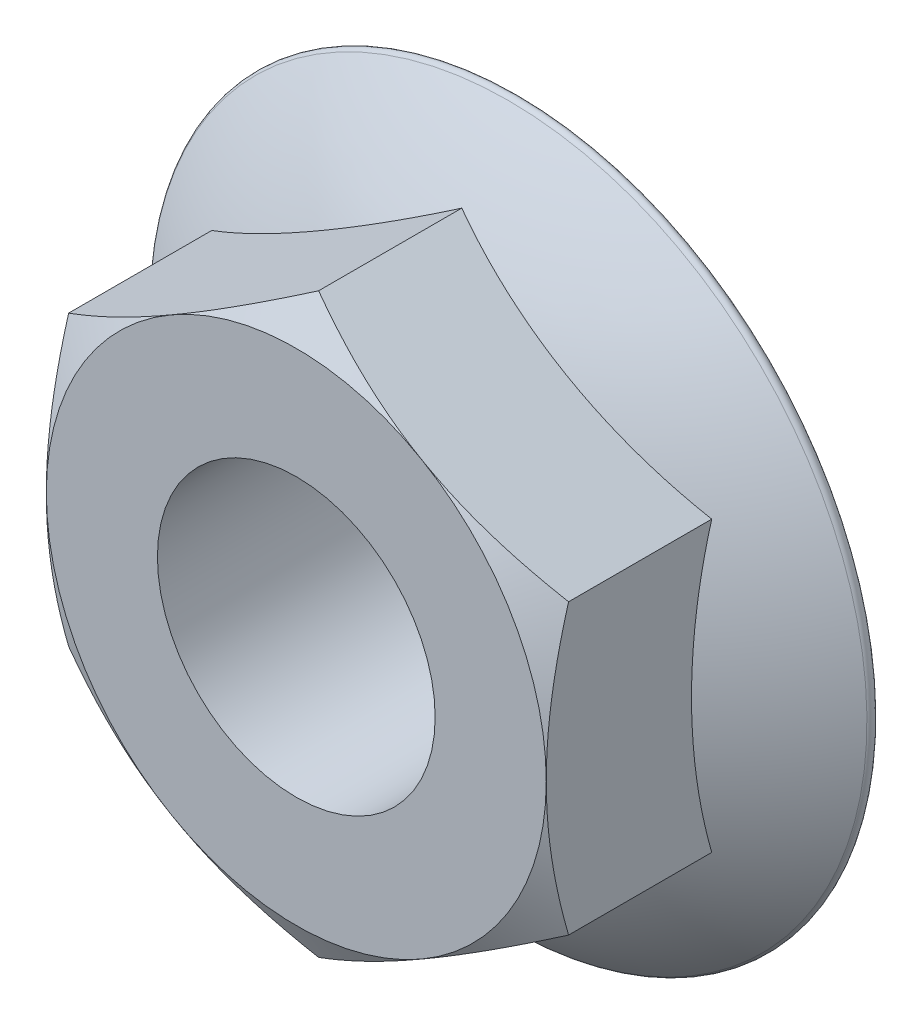
ISO-10303-21;
HEADER;
FILE_DESCRIPTION(('STEP AP214'),'2;1');
FILE_NAME('part.step','',(''),(''),'','','');
FILE_SCHEMA(('AUTOMOTIVE_DESIGN { 1 0 10303 214 1 1 1 1 }'));
ENDSEC;
DATA;
#1=APPLICATION_CONTEXT('core data for automotive mechanical design processes');
#2=APPLICATION_PROTOCOL_DEFINITION('international standard','automotive_design',2000,#1);
#3=PRODUCT_CONTEXT('',#1,'mechanical');
#4=PRODUCT('Part','Part','',(#3));
#5=PRODUCT_RELATED_PRODUCT_CATEGORY('part','',(#4));
#6=PRODUCT_DEFINITION_FORMATION('','',#4);
#7=PRODUCT_DEFINITION_CONTEXT('part definition',#1,'design');
#8=PRODUCT_DEFINITION('design','',#6,#7);
#9=PRODUCT_DEFINITION_SHAPE('','',#8);
#10=(LENGTH_UNIT() NAMED_UNIT(*) SI_UNIT(.MILLI.,.METRE.));
#11=(NAMED_UNIT(*) PLANE_ANGLE_UNIT() SI_UNIT($,.RADIAN.));
#12=(NAMED_UNIT(*) SI_UNIT($,.STERADIAN.) SOLID_ANGLE_UNIT());
#13=UNCERTAINTY_MEASURE_WITH_UNIT(LENGTH_MEASURE(1.E-05),#10,'distance_accuracy_value','');
#14=(GEOMETRIC_REPRESENTATION_CONTEXT(3) GLOBAL_UNCERTAINTY_ASSIGNED_CONTEXT((#13)) GLOBAL_UNIT_ASSIGNED_CONTEXT((#10,
#11,#12)) REPRESENTATION_CONTEXT('',''));
#15=CARTESIAN_POINT('',(0.,0.,0.));
#16=DIRECTION('',(0.,0.,1.));
#17=DIRECTION('',(1.,0.,0.));
#18=AXIS2_PLACEMENT_3D('',#15,#16,#17);
#19=CARTESIAN_POINT('',(0.,-25.9807621135332,20.));
#20=DIRECTION('',(-0.5,0.866025403784439,0.));
#21=DIRECTION('',(-0.866025403784439,-0.5,0.));
#22=AXIS2_PLACEMENT_3D('',#19,#20,#21);
#23=PLANE('',#22);
#24=CARTESIAN_POINT('',(-0.000200000000005805,-25.980877583587,17.9903143896555));
#25=CARTESIAN_POINT('',(0.494340315320349,-25.6953545994117,18.1551492707593));
#26=CARTESIAN_POINT('',(0.990809601239469,-25.4087179235419,18.3125041584607));
#27=CARTESIAN_POINT('',(1.98772926208785,-24.8331460889906,18.6101747825265));
#28=CARTESIAN_POINT('',(2.48818088905228,-24.5442102074463,18.7504849147612));
#29=CARTESIAN_POINT('',(3.49404310444017,-23.9634753866245,19.0121827394148));
#30=CARTESIAN_POINT('',(3.99946257540047,-23.6716713190119,19.1335252438812));
#31=CARTESIAN_POINT('',(5.01379199131473,-23.0860479576868,19.3546738156916));
#32=CARTESIAN_POINT('',(5.52270158333676,-22.7922288677397,19.4544820284597));
#33=CARTESIAN_POINT('',(6.53100308542396,-22.2100857240854,19.6283253044473));
#34=CARTESIAN_POINT('',(7.03032020450329,-21.9218048509739,19.7029352669185));
#35=CARTESIAN_POINT('',(8.03124235456724,-21.3439221781966,19.8280391846674));
#36=CARTESIAN_POINT('',(8.53284742940406,-21.0543203532127,19.8785326757383));
#37=CARTESIAN_POINT('',(9.53690018234172,-20.4746302260236,19.954128715289));
#38=CARTESIAN_POINT('',(10.0393461451645,-20.1845429141346,19.9792614354897));
#39=CARTESIAN_POINT('',(11.0447017408546,-19.6041005903316,20.0035954599864));
#40=CARTESIAN_POINT('',(11.5476113589139,-19.313745586967,20.0027975655861));
#41=CARTESIAN_POINT('',(12.4878094832121,-18.7709219468119,19.9770814657185));
#42=CARTESIAN_POINT('',(12.9251649504396,-18.5184146500766,19.9552991118006));
#43=CARTESIAN_POINT('',(13.7988317564138,-18.0140028844653,19.892536574804));
#44=CARTESIAN_POINT('',(14.2351431100254,-17.7620984070071,19.8515566666916));
#45=CARTESIAN_POINT('',(15.1065604849226,-17.2589853510337,19.7511092481865));
#46=CARTESIAN_POINT('',(15.5416650558498,-17.0077776098833,19.6916250199366));
#47=CARTESIAN_POINT('',(16.4097908378745,-16.5065649559409,19.5552217340813));
#48=CARTESIAN_POINT('',(16.842812057791,-16.2565600380572,19.4783027503465));
#49=CARTESIAN_POINT('',(18.1573722886485,-15.4975983349057,19.2194196562896));
#50=CARTESIAN_POINT('',(19.0351763947766,-14.9907978979369,19.011627893702));
#51=CARTESIAN_POINT('',(20.3421885092524,-14.2361941018102,18.6578721503226));
#52=CARTESIAN_POINT('',(20.7758690162324,-13.985808544363,18.5330695175296));
#53=CARTESIAN_POINT('',(21.6402303188989,-13.4867693135914,18.2708295210671));
#54=CARTESIAN_POINT('',(22.0709119234591,-13.2381151732635,18.1333957185273));
#55=CARTESIAN_POINT('',(22.5002,-12.9902655867127,17.9903143896555));
#56=B_SPLINE_CURVE_WITH_KNOTS('',3,(#24,#25,#26,#27,#28,#29,#30,#31,#32,#33,#34,#35,#36,#37,#38,
#39,#40,#41,#42,#43,#44,#45,#46,#47,#48,#49,#50,#51,#52,#53,#54,#55),.UNSPECIFIED.,.F.,.F.,(4,2,
2,2,2,2,2,2,2,2,2,2,2,2,2,4),(0.,1.78312722203929,3.56683913913433,5.35473780165091,
7.14245825659312,8.88609109738608,10.6297574992032,12.3713470058018,14.1128826941264,
15.6289689473497,17.1450334863602,18.6624717220614,20.1799035285482,23.281607613878,
24.8297579454588,26.3774731352151),.UNSPECIFIED.);
#57=CARTESIAN_POINT('',(0.,-25.9807621135332,17.9903810567666));
#58=VERTEX_POINT('',#57);
#59=CARTESIAN_POINT('',(11.25,-19.4855715851499,20.));
#60=VERTEX_POINT('',#59);
#61=EDGE_CURVE('E224',#58,#60,#56,.T.);
#62=ORIENTED_EDGE('',*,*,#61,.F.);
#63=DIRECTION('',(0.,0.,-1.));
#64=VECTOR('',#63,1.);
#65=CARTESIAN_POINT('',(0.,-25.9807621135332,20.));
#66=LINE('',#65,#64);
#67=CARTESIAN_POINT('',(0.,-25.9807621135332,5.10562126709524));
#68=VERTEX_POINT('',#67);
#69=EDGE_CURVE('E227',#58,#68,#66,.T.);
#70=ORIENTED_EDGE('',*,*,#69,.T.);
#71=CARTESIAN_POINT('',(11.25,-19.4855715851499,-40.4001136363637));
#72=DIRECTION('',(-0.5,0.866025403784439,0.));
#73=DIRECTION('',(-0.866025403784439,-0.5,0.));
#74=AXIS2_PLACEMENT_3D('',#71,#72,#73);
#75=CIRCLE('',#74,47.3235872383305);
#76=CARTESIAN_POINT('',(22.5,-12.9903810567666,5.10562126709525));
#77=VERTEX_POINT('',#76);
#78=EDGE_CURVE('E238',#77,#68,#75,.F.);
#79=ORIENTED_EDGE('',*,*,#78,.F.);
#80=DIRECTION('',(0.,0.,-1.));
#81=VECTOR('',#80,1.);
#82=CARTESIAN_POINT('',(22.5,-12.9903810567666,20.));
#83=LINE('',#82,#81);
#84=CARTESIAN_POINT('',(22.5,-12.9903810567666,17.9903810567666));
#85=VERTEX_POINT('',#84);
#86=EDGE_CURVE('E250',#85,#77,#83,.T.);
#87=ORIENTED_EDGE('',*,*,#86,.F.);
#88=EDGE_CURVE('E177',#60,#85,#56,.T.);
#89=ORIENTED_EDGE('',*,*,#88,.F.);
#90=EDGE_LOOP('',(#62,#70,#79,#87,#89));
#91=FACE_BOUND('',#90,.T.);
#92=ADVANCED_FACE('F45',(#91),#23,.F.);
#93=CARTESIAN_POINT('',(22.5,-12.9903810567666,20.));
#94=DIRECTION('',(-1.,0.,0.));
#95=DIRECTION('',(0.,-1.,0.));
#96=AXIS2_PLACEMENT_3D('',#93,#94,#95);
#97=PLANE('',#96);
#98=CARTESIAN_POINT('',(22.5,-42.937910116955,5.00279973211657));
#99=CARTESIAN_POINT('',(22.5,-42.4349867908762,5.25998830996277));
#100=CARTESIAN_POINT('',(22.5,-41.9316712448641,5.51640961946833));
#101=CARTESIAN_POINT('',(22.5,-40.9241808993457,6.02756274502809));
#102=CARTESIAN_POINT('',(22.5,-40.4200060968718,6.28229455523246));
#103=CARTESIAN_POINT('',(22.5,-38.906067399752,7.04372989587429));
#104=CARTESIAN_POINT('',(22.5,-37.8949075563431,7.54766394292194));
#105=CARTESIAN_POINT('',(22.5,-35.8664336922577,8.54744404798991));
#106=CARTESIAN_POINT('',(22.5,-34.849112085713,9.04327473279685));
#107=CARTESIAN_POINT('',(22.5,-32.8091562949487,10.0239453406089));
#108=CARTESIAN_POINT('',(22.5,-31.7865220333206,10.5087851029147));
#109=CARTESIAN_POINT('',(22.5,-29.6826836887022,11.489168716423));
#110=CARTESIAN_POINT('',(22.5,-28.6011475492797,11.9840015357758));
#111=CARTESIAN_POINT('',(22.5,-26.4295684611349,12.9545883452375));
#112=CARTESIAN_POINT('',(22.5,-25.3395259663007,13.4303433451106));
#113=CARTESIAN_POINT('',(22.5,-23.6970388665296,14.1254074700941));
#114=CARTESIAN_POINT('',(22.5,-23.1484886270678,14.3539282550564));
#115=CARTESIAN_POINT('',(22.5,-22.0485270558716,14.8039685587357));
#116=CARTESIAN_POINT('',(22.5,-21.4971157654287,15.0254881781701));
#117=CARTESIAN_POINT('',(22.5,-20.3909977243873,15.4606074265542));
#118=CARTESIAN_POINT('',(22.5,-19.8362901159973,15.6742048789127));
#119=CARTESIAN_POINT('',(22.5,-18.7234476974617,16.0922649956442));
#120=CARTESIAN_POINT('',(22.5,-18.1653129401696,16.2967278004915));
#121=CARTESIAN_POINT('',(22.5,-16.9449865841485,16.7309016542748));
#122=CARTESIAN_POINT('',(22.5,-16.2820662225517,16.9585738291773));
#123=CARTESIAN_POINT('',(22.5,-14.9505731173334,17.3968937659042));
#124=CARTESIAN_POINT('',(22.5,-14.2820001805723,17.6075409433931));
#125=CARTESIAN_POINT('',(22.5,-12.9391673365046,18.0088123953236));
#126=CARTESIAN_POINT('',(22.5,-12.2649101120209,18.1994456005083));
#127=CARTESIAN_POINT('',(22.5,-10.9102777489049,18.557528643239));
#128=CARTESIAN_POINT('',(22.5,-10.2299030383091,18.7249800895596));
#129=CARTESIAN_POINT('',(22.5,-8.87571641326102,19.0303528579027));
#130=CARTESIAN_POINT('',(22.5,-8.20201537871786,19.1687624656118));
#131=CARTESIAN_POINT('',(22.5,-6.84925952001051,19.4164959045111));
#132=CARTESIAN_POINT('',(22.5,-6.17020484117955,19.5258205224797));
#133=CARTESIAN_POINT('',(22.5,-4.8079571222068,19.7122164762278));
#134=CARTESIAN_POINT('',(22.5,-4.12476611922572,19.7893025566878));
#135=CARTESIAN_POINT('',(22.5,-2.75533096919535,19.9087926707029));
#136=CARTESIAN_POINT('',(22.5,-2.06908684258475,19.9511969360801));
#137=CARTESIAN_POINT('',(22.5,-0.687324246377995,20.0001091636126));
#138=CARTESIAN_POINT('',(22.5,0.00820938704600616,20.0061945929854));
#139=CARTESIAN_POINT('',(22.5,1.39859832033208,19.9811125243047));
#140=CARTESIAN_POINT('',(22.5,2.09345361787948,19.9499448995746));
#141=CARTESIAN_POINT('',(22.5,3.48080015469796,19.8514850050863));
#142=CARTESIAN_POINT('',(22.5,4.1732905467787,19.7841809279115));
#143=CARTESIAN_POINT('',(22.5,5.55411755952299,19.6157455550603));
#144=CARTESIAN_POINT('',(22.5,6.24245408545504,19.5146134908613));
#145=CARTESIAN_POINT('',(22.5,7.62722706977454,19.2793387973371));
#146=CARTESIAN_POINT('',(22.5,8.32355984305465,19.1445910821305));
#147=CARTESIAN_POINT('',(22.5,9.71010675509671,18.846809177478));
#148=CARTESIAN_POINT('',(22.5,10.4003208338406,18.6837747108902));
#149=CARTESIAN_POINT('',(22.5,11.7745189775227,18.3330815856482));
#150=CARTESIAN_POINT('',(22.5,12.4585022055107,18.1454196696198));
#151=CARTESIAN_POINT('',(22.5,13.8202809477323,17.7489421717333));
#152=CARTESIAN_POINT('',(22.5,14.4980764221406,17.5401264538304));
#153=CARTESIAN_POINT('',(22.5,15.7921426442065,17.122402240074));
#154=CARTESIAN_POINT('',(22.5,16.408876911634,16.9149219806037));
#155=CARTESIAN_POINT('',(22.5,17.6377869149723,16.4868319747096));
#156=CARTESIAN_POINT('',(22.5,18.2499624656504,16.2662216980187));
#157=CARTESIAN_POINT('',(22.5,19.4702017344588,15.8136516015775));
#158=CARTESIAN_POINT('',(22.5,20.0782647898368,15.5816899998701));
#159=CARTESIAN_POINT('',(22.5,21.2905575041822,15.1079993142826));
#160=CARTESIAN_POINT('',(22.5,21.8947872099299,14.8662703498649));
#161=CARTESIAN_POINT('',(22.5,23.1003484017779,14.3741314470397));
#162=CARTESIAN_POINT('',(22.5,23.7016766801851,14.1237136653835));
#163=CARTESIAN_POINT('',(22.5,24.9012239962781,13.6155267116629));
#164=CARTESIAN_POINT('',(22.5,25.4994429898334,13.3577574355927));
#165=CARTESIAN_POINT('',(22.5,26.6930217519426,12.8358485601786));
#166=CARTESIAN_POINT('',(22.5,27.2883817976791,12.5717095939821));
#167=CARTESIAN_POINT('',(22.5,28.4765906338492,12.0378380893407));
#168=CARTESIAN_POINT('',(22.5,29.0694394044817,11.7681055068895));
#169=CARTESIAN_POINT('',(22.5,30.7817709336552,10.9804762057214));
#170=CARTESIAN_POINT('',(22.5,31.8983456673484,10.4562536555283));
#171=CARTESIAN_POINT('',(22.5,34.124920581488,9.39399908091057));
#172=CARTESIAN_POINT('',(22.5,35.2349205776655,8.8559666716726));
#173=CARTESIAN_POINT('',(22.5,37.4463300983147,7.77041638266379));
#174=CARTESIAN_POINT('',(22.5,38.5477551094307,7.22293001683052));
#175=CARTESIAN_POINT('',(22.5,40.1964930693805,6.39505102381712));
#176=CARTESIAN_POINT('',(22.5,40.745485226106,6.117993657155));
#177=CARTESIAN_POINT('',(22.5,41.8424430578517,5.56186024348552));
#178=CARTESIAN_POINT('',(22.5,42.3904087376387,5.28278420588177));
#179=CARTESIAN_POINT('',(22.5,42.937910116955,5.00279973211658));
#180=B_SPLINE_CURVE_WITH_KNOTS('',3,(#98,#99,#100,#101,#102,#103,#104,#105,#106,#107,#108,#109,
#110,#111,#112,#113,#114,#115,#116,#117,#118,#119,#120,#121,#122,#123,#124,#125,#126,#127,#128,
#129,#130,#131,#132,#133,#134,#135,#136,#137,#138,#139,#140,#141,#142,#143,#144,#145,#146,#147,
#148,#149,#150,#151,#152,#153,#154,#155,#156,#157,#158,#159,#160,#161,#162,#163,#164,#165,#166,
#167,#168,#169,#170,#171,#172,#173,#174,#175,#176,#177,#178,#179),.UNSPECIFIED.,.F.,.F.,(4,2,2,
2,2,2,2,2,2,2,2,2,2,2,2,2,2,2,2,2,2,2,2,2,2,2,2,2,2,2,2,2,2,2,2,2,2,2,2,2,4),(0.,
1.69460800721614,3.38922187888549,6.77851144025748,10.1736205822667,13.5687793325238,
17.1367290228506,20.7044896163155,22.4871908668035,24.2698664600163,26.0530282634379,
27.83616263562,29.9387425585486,32.0413946160485,34.1431043928186,36.2446682413239,
38.307417211311,40.3701103761814,42.431859109237,44.4935940609253,46.579269162215,
48.6649513557284,50.7513154512245,52.8377269490868,54.9648116511539,57.0919171946992,
59.2193043660852,61.3467052200283,63.2986367527605,65.250647169518,67.2029650065895,
69.1552589725683,71.1093635950016,73.0634958770022,75.0174347123852,76.9713889257113,
80.6717851506886,84.3722845998144,88.0622051563254,89.9070267613382,91.7518397781164),.UNSPECIFIED.);
#181=CARTESIAN_POINT('',(22.5,0.,20.));
#182=VERTEX_POINT('',#181);
#183=EDGE_CURVE('E278',#85,#182,#180,.T.);
#184=ORIENTED_EDGE('',*,*,#183,.F.);
#185=ORIENTED_EDGE('',*,*,#86,.T.);
#186=CARTESIAN_POINT('',(22.5,0.,-40.4001136363637));
#187=DIRECTION('',(-1.,0.,0.));
#188=DIRECTION('',(0.,-1.,0.));
#189=AXIS2_PLACEMENT_3D('',#186,#187,#188);
#190=CIRCLE('',#189,47.3235872383305);
#191=CARTESIAN_POINT('',(22.5,12.9903810567666,5.10562126709525));
#192=VERTEX_POINT('',#191);
#193=EDGE_CURVE('E242',#192,#77,#190,.F.);
#194=ORIENTED_EDGE('',*,*,#193,.F.);
#195=DIRECTION('',(0.,0.,-1.));
#196=VECTOR('',#195,1.);
#197=CARTESIAN_POINT('',(22.5,12.9903810567666,20.));
#198=LINE('',#197,#196);
#199=CARTESIAN_POINT('',(22.5,12.9903810567666,17.9903810567666));
#200=VERTEX_POINT('',#199);
#201=EDGE_CURVE('E248',#200,#192,#198,.T.);
#202=ORIENTED_EDGE('',*,*,#201,.F.);
#203=EDGE_CURVE('E121',#182,#200,#180,.T.);
#204=ORIENTED_EDGE('',*,*,#203,.F.);
#205=EDGE_LOOP('',(#184,#185,#194,#202,#204));
#206=FACE_BOUND('',#205,.T.);
#207=ADVANCED_FACE('F214',(#206),#97,.F.);
#208=CARTESIAN_POINT('',(22.5,12.9903810567666,20.));
#209=DIRECTION('',(-0.5,-0.866025403784439,0.));
#210=DIRECTION('',(0.866025403784439,-0.5,0.));
#211=AXIS2_PLACEMENT_3D('',#208,#209,#210);
#212=PLANE('',#211);
#213=CARTESIAN_POINT('',(22.5002,12.9902655867127,17.9903143896555));
#214=CARTESIAN_POINT('',(22.0056596846796,13.2757885708881,18.1551492707593));
#215=CARTESIAN_POINT('',(21.5091903987605,13.5624252467579,18.3125041584607));
#216=CARTESIAN_POINT('',(20.5122707379121,14.1379970813091,18.6101747825265));
#217=CARTESIAN_POINT('',(20.0118191109477,14.4269329628534,18.7504849147612));
#218=CARTESIAN_POINT('',(19.0059568955598,15.0076677836753,19.0121827394149));
#219=CARTESIAN_POINT('',(18.5005374245995,15.2994718512879,19.1335252438812));
#220=CARTESIAN_POINT('',(17.4862080086853,15.8850952126129,19.3546738156916));
#221=CARTESIAN_POINT('',(16.9772984166632,16.17891430256,19.4544820284597));
#222=CARTESIAN_POINT('',(15.968996914576,16.7610574462144,19.6283253044473));
#223=CARTESIAN_POINT('',(15.4696797954967,17.0493383193258,19.7029352669185));
#224=CARTESIAN_POINT('',(14.4687576454327,17.6272209921031,19.8280391846674));
#225=CARTESIAN_POINT('',(13.9671525705959,17.916822817087,19.8785326757383));
#226=CARTESIAN_POINT('',(12.9630998176583,18.4965129442762,19.954128715289));
#227=CARTESIAN_POINT('',(12.4606538548355,18.7866002561651,19.9792614354897));
#228=CARTESIAN_POINT('',(11.4552982591454,19.3670425799681,20.0035954599864));
#229=CARTESIAN_POINT('',(10.9523886410861,19.6573975833327,20.0027975655861));
#230=CARTESIAN_POINT('',(10.0121905167879,20.2002212234879,19.9770814657185));
#231=CARTESIAN_POINT('',(9.57483504956041,20.4527285202232,19.9552991118006));
#232=CARTESIAN_POINT('',(8.70116824358617,20.9571402858345,19.892536574804));
#233=CARTESIAN_POINT('',(8.26485688997455,21.2090447632926,19.8515566666916));
#234=CARTESIAN_POINT('',(7.39343951507734,21.712157819266,19.7511092481865));
#235=CARTESIAN_POINT('',(6.95833494415014,21.9633655604165,19.6916250199366));
#236=CARTESIAN_POINT('',(6.09020916212553,22.4645782143589,19.5552217340813));
#237=CARTESIAN_POINT('',(5.65718794220898,22.7145831322425,19.4783027503465));
#238=CARTESIAN_POINT('',(4.34262771135151,23.473544835394,19.2194196562896));
#239=CARTESIAN_POINT('',(3.46482360522341,23.9803452723629,19.011627893702));
#240=CARTESIAN_POINT('',(2.15781149074758,24.7349490684896,18.6578721503226));
#241=CARTESIAN_POINT('',(1.72413098376758,24.9853346259368,18.5330695175296));
#242=CARTESIAN_POINT('',(0.859769681101054,25.4843738567084,18.2708295210671));
#243=CARTESIAN_POINT('',(0.429088076540868,25.7330279970362,18.1333957185273));
#244=CARTESIAN_POINT('',(-0.000200000000013364,25.980877583587,17.9903143896555));
#245=B_SPLINE_CURVE_WITH_KNOTS('',3,(#213,#214,#215,#216,#217,#218,#219,#220,#221,#222,#223,
#224,#225,#226,#227,#228,#229,#230,#231,#232,#233,#234,#235,#236,#237,#238,#239,#240,#241,#242,
#243,#244),.UNSPECIFIED.,.F.,.F.,(4,2,2,2,2,2,2,2,2,2,2,2,2,2,2,4),(0.,1.78312722203929,
3.56683913913433,5.35473780165091,7.14245825659311,8.88609109738607,10.6297574992032,
12.3713470058018,14.1128826941264,15.6289689473497,17.1450334863602,18.6624717220614,
20.1799035285482,23.281607613878,24.8297579454588,26.3774731352151),.UNSPECIFIED.);
#246=CARTESIAN_POINT('',(11.25,19.4855715851499,20.));
#247=VERTEX_POINT('',#246);
#248=EDGE_CURVE('E117',#200,#247,#245,.T.);
#249=ORIENTED_EDGE('',*,*,#248,.F.);
#250=ORIENTED_EDGE('',*,*,#201,.T.);
#251=CARTESIAN_POINT('',(11.25,19.4855715851499,-40.4001136363637));
#252=DIRECTION('',(-0.5,-0.866025403784439,0.));
#253=DIRECTION('',(0.866025403784439,-0.5,0.));
#254=AXIS2_PLACEMENT_3D('',#251,#252,#253);
#255=CIRCLE('',#254,47.3235872383305);
#256=CARTESIAN_POINT('',(0.,25.9807621135332,5.10562126709525));
#257=VERTEX_POINT('',#256);
#258=EDGE_CURVE('E268',#257,#192,#255,.F.);
#259=ORIENTED_EDGE('',*,*,#258,.F.);
#260=DIRECTION('',(0.,0.,-1.));
#261=VECTOR('',#260,1.);
#262=CARTESIAN_POINT('',(0.,25.9807621135332,20.));
#263=LINE('',#262,#261);
#264=CARTESIAN_POINT('',(0.,25.9807621135332,17.9903810567666));
#265=VERTEX_POINT('',#264);
#266=EDGE_CURVE('E142',#265,#257,#263,.T.);
#267=ORIENTED_EDGE('',*,*,#266,.F.);
#268=EDGE_CURVE('E125',#247,#265,#245,.T.);
#269=ORIENTED_EDGE('',*,*,#268,.F.);
#270=EDGE_LOOP('',(#249,#250,#259,#267,#269));
#271=FACE_BOUND('',#270,.T.);
#272=ADVANCED_FACE('F140',(#271),#212,.F.);
#273=CARTESIAN_POINT('',(0.,25.9807621135332,20.));
#274=DIRECTION('',(0.5,-0.866025403784439,0.));
#275=DIRECTION('',(0.866025403784439,0.5,0.));
#276=AXIS2_PLACEMENT_3D('',#273,#274,#275);
#277=PLANE('',#276);
#278=CARTESIAN_POINT('',(0.00019999999998839,25.980877583587,17.9903143896555));
#279=CARTESIAN_POINT('',(-0.494340315320368,25.6953545994117,18.1551492707593));
#280=CARTESIAN_POINT('',(-0.990809601239488,25.4087179235419,18.3125041584607));
#281=CARTESIAN_POINT('',(-1.98772926208787,24.8331460889906,18.6101747825265));
#282=CARTESIAN_POINT('',(-2.4881808890523,24.5442102074463,18.7504849147612));
#283=CARTESIAN_POINT('',(-3.49404310444018,23.9634753866245,19.0121827394148));
#284=CARTESIAN_POINT('',(-3.99946257540049,23.6716713190119,19.1335252438812));
#285=CARTESIAN_POINT('',(-5.01379199131475,23.0860479576868,19.3546738156916));
#286=CARTESIAN_POINT('',(-5.52270158333678,22.7922288677397,19.4544820284597));
#287=CARTESIAN_POINT('',(-6.53100308542397,22.2100857240854,19.6283253044473));
#288=CARTESIAN_POINT('',(-7.0303202045033,21.9218048509739,19.7029352669185));
#289=CARTESIAN_POINT('',(-8.03124235456726,21.3439221781966,19.8280391846674));
#290=CARTESIAN_POINT('',(-8.53284742940407,21.0543203532127,19.8785326757383));
#291=CARTESIAN_POINT('',(-9.53690018234173,20.4746302260236,19.954128715289));
#292=CARTESIAN_POINT('',(-10.0393461451645,20.1845429141346,19.9792614354897));
#293=CARTESIAN_POINT('',(-11.0447017408546,19.6041005903316,20.0035954599864));
#294=CARTESIAN_POINT('',(-11.5476113589139,19.313745586967,20.0027975655861));
#295=CARTESIAN_POINT('',(-12.4878094832121,18.7709219468119,19.9770814657185));
#296=CARTESIAN_POINT('',(-12.9251649504396,18.5184146500766,19.9552991118006));
#297=CARTESIAN_POINT('',(-13.7988317564138,18.0140028844653,19.892536574804));
#298=CARTESIAN_POINT('',(-14.2351431100254,17.7620984070071,19.8515566666916));
#299=CARTESIAN_POINT('',(-15.1065604849227,17.2589853510337,19.7511092481865));
#300=CARTESIAN_POINT('',(-15.5416650558499,17.0077776098832,19.6916250199366));
#301=CARTESIAN_POINT('',(-16.4097908378745,16.5065649559409,19.5552217340813));
#302=CARTESIAN_POINT('',(-16.842812057791,16.2565600380572,19.4783027503465));
#303=CARTESIAN_POINT('',(-18.1573722886485,15.4975983349057,19.2194196562896));
#304=CARTESIAN_POINT('',(-19.0351763947766,14.9907978979369,19.011627893702));
#305=CARTESIAN_POINT('',(-20.3421885092524,14.2361941018102,18.6578721503226));
#306=CARTESIAN_POINT('',(-20.7758690162324,13.985808544363,18.5330695175296));
#307=CARTESIAN_POINT('',(-21.6402303188989,13.4867693135914,18.2708295210671));
#308=CARTESIAN_POINT('',(-22.0709119234591,13.2381151732635,18.1333957185273));
#309=CARTESIAN_POINT('',(-22.5002,12.9902655867127,17.9903143896555));
#310=B_SPLINE_CURVE_WITH_KNOTS('',3,(#278,#279,#280,#281,#282,#283,#284,#285,#286,#287,#288,
#289,#290,#291,#292,#293,#294,#295,#296,#297,#298,#299,#300,#301,#302,#303,#304,#305,#306,#307,
#308,#309),.UNSPECIFIED.,.F.,.F.,(4,2,2,2,2,2,2,2,2,2,2,2,2,2,2,4),(0.,1.78312722203929,
3.56683913913433,5.35473780165091,7.14245825659312,8.88609109738608,10.6297574992032,
12.3713470058018,14.1128826941264,15.6289689473497,17.1450334863602,18.6624717220614,
20.1799035285482,23.281607613878,24.8297579454588,26.3774731352151),.UNSPECIFIED.);
#311=CARTESIAN_POINT('',(-11.25,19.4855715851499,20.));
#312=VERTEX_POINT('',#311);
#313=EDGE_CURVE('E130',#265,#312,#310,.T.);
#314=ORIENTED_EDGE('',*,*,#313,.F.);
#315=ORIENTED_EDGE('',*,*,#266,.T.);
#316=CARTESIAN_POINT('',(-11.25,19.4855715851499,-40.4001136363637));
#317=DIRECTION('',(0.5,-0.866025403784439,0.));
#318=DIRECTION('',(0.866025403784439,0.5,0.));
#319=AXIS2_PLACEMENT_3D('',#316,#317,#318);
#320=CIRCLE('',#319,47.3235872383305);
#321=CARTESIAN_POINT('',(-22.5,12.9903810567666,5.10562126709524));
#322=VERTEX_POINT('',#321);
#323=EDGE_CURVE('E265',#322,#257,#320,.F.);
#324=ORIENTED_EDGE('',*,*,#323,.F.);
#325=DIRECTION('',(0.,0.,-1.));
#326=VECTOR('',#325,1.);
#327=CARTESIAN_POINT('',(-22.5,12.9903810567666,20.));
#328=LINE('',#327,#326);
#329=CARTESIAN_POINT('',(-22.5,12.9903810567666,17.9903810567666));
#330=VERTEX_POINT('',#329);
#331=EDGE_CURVE('E240',#330,#322,#328,.T.);
#332=ORIENTED_EDGE('',*,*,#331,.F.);
#333=EDGE_CURVE('E143',#312,#330,#310,.T.);
#334=ORIENTED_EDGE('',*,*,#333,.F.);
#335=EDGE_LOOP('',(#314,#315,#324,#332,#334));
#336=FACE_BOUND('',#335,.T.);
#337=ADVANCED_FACE('F204',(#336),#277,.F.);
#338=CARTESIAN_POINT('',(-22.5,12.9903810567666,20.));
#339=DIRECTION('',(1.,0.,0.));
#340=DIRECTION('',(0.,1.,0.));
#341=AXIS2_PLACEMENT_3D('',#338,#339,#340);
#342=PLANE('',#341);
#343=CARTESIAN_POINT('',(-22.5,42.937910116955,5.00279973211657));
#344=CARTESIAN_POINT('',(-22.5,42.4349867908762,5.25998830996277));
#345=CARTESIAN_POINT('',(-22.5,41.9316712448641,5.51640961946832));
#346=CARTESIAN_POINT('',(-22.5,40.9241808993457,6.02756274502808));
#347=CARTESIAN_POINT('',(-22.5,40.4200060968718,6.28229455523246));
#348=CARTESIAN_POINT('',(-22.5,38.906067399752,7.04372989587429));
#349=CARTESIAN_POINT('',(-22.5,37.8949075563432,7.54766394292194));
#350=CARTESIAN_POINT('',(-22.5,35.8664336922577,8.54744404798992));
#351=CARTESIAN_POINT('',(-22.5,34.849112085713,9.04327473279686));
#352=CARTESIAN_POINT('',(-22.5,32.8091562949487,10.0239453406089));
#353=CARTESIAN_POINT('',(-22.5,31.7865220333206,10.5087851029147));
#354=CARTESIAN_POINT('',(-22.5,29.6826836887022,11.489168716423));
#355=CARTESIAN_POINT('',(-22.5,28.6011475492797,11.9840015357758));
#356=CARTESIAN_POINT('',(-22.5,26.4295684611349,12.9545883452375));
#357=CARTESIAN_POINT('',(-22.5,25.3395259663007,13.4303433451106));
#358=CARTESIAN_POINT('',(-22.5,23.6970388665296,14.1254074700941));
#359=CARTESIAN_POINT('',(-22.5,23.1484886270678,14.3539282550564));
#360=CARTESIAN_POINT('',(-22.5,22.0485270558716,14.8039685587357));
#361=CARTESIAN_POINT('',(-22.5,21.4971157654287,15.0254881781701));
#362=CARTESIAN_POINT('',(-22.5,20.3909977243873,15.4606074265542));
#363=CARTESIAN_POINT('',(-22.5,19.8362901159973,15.6742048789127));
#364=CARTESIAN_POINT('',(-22.5,18.7234476974617,16.0922649956442));
#365=CARTESIAN_POINT('',(-22.5,18.1653129401696,16.2967278004915));
#366=CARTESIAN_POINT('',(-22.5,16.9449865841485,16.7309016542748));
#367=CARTESIAN_POINT('',(-22.5,16.2820662225517,16.9585738291773));
#368=CARTESIAN_POINT('',(-22.5,14.9505731173334,17.3968937659042));
#369=CARTESIAN_POINT('',(-22.5,14.2820001805723,17.6075409433931));
#370=CARTESIAN_POINT('',(-22.5,12.9391673365046,18.0088123953236));
#371=CARTESIAN_POINT('',(-22.5,12.2649101120209,18.1994456005083));
#372=CARTESIAN_POINT('',(-22.5,10.9102777489049,18.557528643239));
#373=CARTESIAN_POINT('',(-22.5,10.2299030383091,18.7249800895596));
#374=CARTESIAN_POINT('',(-22.5,8.87571641326102,19.0303528579027));
#375=CARTESIAN_POINT('',(-22.5,8.20201537871786,19.1687624656118));
#376=CARTESIAN_POINT('',(-22.5,6.84925952001052,19.4164959045111));
#377=CARTESIAN_POINT('',(-22.5,6.17020484117955,19.5258205224797));
#378=CARTESIAN_POINT('',(-22.5,4.8079571222068,19.7122164762278));
#379=CARTESIAN_POINT('',(-22.5,4.12476611922572,19.7893025566878));
#380=CARTESIAN_POINT('',(-22.5,2.75533096919535,19.9087926707029));
#381=CARTESIAN_POINT('',(-22.5,2.06908684258475,19.9511969360801));
#382=CARTESIAN_POINT('',(-22.5,0.687324246377998,20.0001091636126));
#383=CARTESIAN_POINT('',(-22.5,-0.00820938704600279,20.0061945929854));
#384=CARTESIAN_POINT('',(-22.5,-1.39859832033208,19.9811125243047));
#385=CARTESIAN_POINT('',(-22.5,-2.09345361787947,19.9499448995746));
#386=CARTESIAN_POINT('',(-22.5,-3.48080015469796,19.8514850050863));
#387=CARTESIAN_POINT('',(-22.5,-4.17329054677869,19.7841809279115));
#388=CARTESIAN_POINT('',(-22.5,-5.55411755952298,19.6157455550602));
#389=CARTESIAN_POINT('',(-22.5,-6.24245408545503,19.5146134908613));
#390=CARTESIAN_POINT('',(-22.5,-7.62722706977454,19.2793387973371));
#391=CARTESIAN_POINT('',(-22.5,-8.32355984305464,19.1445910821305));
#392=CARTESIAN_POINT('',(-22.5,-9.7101067550967,18.846809177478));
#393=CARTESIAN_POINT('',(-22.5,-10.4003208338406,18.6837747108902));
#394=CARTESIAN_POINT('',(-22.5,-11.7745189775227,18.3330815856482));
#395=CARTESIAN_POINT('',(-22.5,-12.4585022055107,18.1454196696198));
#396=CARTESIAN_POINT('',(-22.5,-13.8202809477323,17.7489421717333));
#397=CARTESIAN_POINT('',(-22.5,-14.4980764221406,17.5401264538304));
#398=CARTESIAN_POINT('',(-22.5,-15.7921426442065,17.122402240074));
#399=CARTESIAN_POINT('',(-22.5,-16.408876911634,16.9149219806036));
#400=CARTESIAN_POINT('',(-22.5,-17.6377869149723,16.4868319747096));
#401=CARTESIAN_POINT('',(-22.5,-18.2499624656504,16.2662216980187));
#402=CARTESIAN_POINT('',(-22.5,-19.4702017344588,15.8136516015775));
#403=CARTESIAN_POINT('',(-22.5,-20.0782647898368,15.5816899998701));
#404=CARTESIAN_POINT('',(-22.5,-21.2905575041822,15.1079993142826));
#405=CARTESIAN_POINT('',(-22.5,-21.8947872099299,14.8662703498649));
#406=CARTESIAN_POINT('',(-22.5,-23.1003484017779,14.3741314470397));
#407=CARTESIAN_POINT('',(-22.5,-23.7016766801851,14.1237136653835));
#408=CARTESIAN_POINT('',(-22.5,-24.9012239962781,13.6155267116629));
#409=CARTESIAN_POINT('',(-22.5,-25.4994429898334,13.3577574355927));
#410=CARTESIAN_POINT('',(-22.5,-26.6930217519426,12.8358485601786));
#411=CARTESIAN_POINT('',(-22.5,-27.2883817976791,12.5717095939821));
#412=CARTESIAN_POINT('',(-22.5,-28.4765906338492,12.0378380893407));
#413=CARTESIAN_POINT('',(-22.5,-29.0694394044817,11.7681055068895));
#414=CARTESIAN_POINT('',(-22.5,-30.7817709336552,10.9804762057214));
#415=CARTESIAN_POINT('',(-22.5,-31.8983456673485,10.4562536555283));
#416=CARTESIAN_POINT('',(-22.5,-34.124920581488,9.39399908091056));
#417=CARTESIAN_POINT('',(-22.5,-35.2349205776655,8.8559666716726));
#418=CARTESIAN_POINT('',(-22.5,-37.4463300983147,7.77041638266379));
#419=CARTESIAN_POINT('',(-22.5,-38.5477551094307,7.22293001683052));
#420=CARTESIAN_POINT('',(-22.5,-40.1964930693805,6.39505102381711));
#421=CARTESIAN_POINT('',(-22.5,-40.745485226106,6.11799365715499));
#422=CARTESIAN_POINT('',(-22.5,-41.8424430578517,5.56186024348551));
#423=CARTESIAN_POINT('',(-22.5,-42.3904087376387,5.28278420588176));
#424=CARTESIAN_POINT('',(-22.5,-42.937910116955,5.00279973211658));
#425=B_SPLINE_CURVE_WITH_KNOTS('',3,(#343,#344,#345,#346,#347,#348,#349,#350,#351,#352,#353,
#354,#355,#356,#357,#358,#359,#360,#361,#362,#363,#364,#365,#366,#367,#368,#369,#370,#371,#372,
#373,#374,#375,#376,#377,#378,#379,#380,#381,#382,#383,#384,#385,#386,#387,#388,#389,#390,#391,
#392,#393,#394,#395,#396,#397,#398,#399,#400,#401,#402,#403,#404,#405,#406,#407,#408,#409,#410,
#411,#412,#413,#414,#415,#416,#417,#418,#419,#420,#421,#422,#423,#424),.UNSPECIFIED.,.F.,.F.,(4,
2,2,2,2,2,2,2,2,2,2,2,2,2,2,2,2,2,2,2,2,2,2,2,2,2,2,2,2,2,2,2,2,2,2,2,2,2,2,2,4),(0.,
1.69460800721614,3.38922187888549,6.77851144025747,10.1736205822667,13.5687793325238,
17.1367290228506,20.7044896163155,22.4871908668035,24.2698664600163,26.0530282634379,
27.83616263562,29.9387425585486,32.0413946160485,34.1431043928186,36.2446682413239,
38.307417211311,40.3701103761814,42.431859109237,44.4935940609253,46.579269162215,
48.6649513557284,50.7513154512245,52.8377269490868,54.9648116511539,57.0919171946992,
59.2193043660852,61.3467052200283,63.2986367527605,65.250647169518,67.2029650065895,
69.1552589725683,71.1093635950016,73.0634958770022,75.0174347123852,76.9713889257113,
80.6717851506886,84.3722845998144,88.0622051563254,89.9070267613382,91.7518397781164),.UNSPECIFIED.);
#426=CARTESIAN_POINT('',(-22.5,0.,20.));
#427=VERTEX_POINT('',#426);
#428=EDGE_CURVE('E198',#330,#427,#425,.T.);
#429=ORIENTED_EDGE('',*,*,#428,.F.);
#430=ORIENTED_EDGE('',*,*,#331,.T.);
#431=CARTESIAN_POINT('',(-22.5,0.,-40.4001136363637));
#432=DIRECTION('',(1.,0.,0.));
#433=DIRECTION('',(0.,1.,0.));
#434=AXIS2_PLACEMENT_3D('',#431,#432,#433);
#435=CIRCLE('',#434,47.3235872383305);
#436=CARTESIAN_POINT('',(-22.5,-12.9903810567666,5.10562126709525));
#437=VERTEX_POINT('',#436);
#438=EDGE_CURVE('E262',#437,#322,#435,.F.);
#439=ORIENTED_EDGE('',*,*,#438,.F.);
#440=DIRECTION('',(0.,0.,-1.));
#441=VECTOR('',#440,1.);
#442=CARTESIAN_POINT('',(-22.5,-12.9903810567666,20.));
#443=LINE('',#442,#441);
#444=CARTESIAN_POINT('',(-22.5,-12.9903810567666,17.9903810567666));
#445=VERTEX_POINT('',#444);
#446=EDGE_CURVE('E237',#445,#437,#443,.T.);
#447=ORIENTED_EDGE('',*,*,#446,.F.);
#448=EDGE_CURVE('E192',#427,#445,#425,.T.);
#449=ORIENTED_EDGE('',*,*,#448,.F.);
#450=EDGE_LOOP('',(#429,#430,#439,#447,#449));
#451=FACE_BOUND('',#450,.T.);
#452=ADVANCED_FACE('F200',(#451),#342,.F.);
#453=CARTESIAN_POINT('',(-22.5,-12.9903810567666,20.));
#454=DIRECTION('',(0.5,0.866025403784439,0.));
#455=DIRECTION('',(-0.866025403784439,0.5,0.));
#456=AXIS2_PLACEMENT_3D('',#453,#454,#455);
#457=PLANE('',#456);
#458=CARTESIAN_POINT('',(-22.5002,-12.9902655867127,17.9903143896555));
#459=CARTESIAN_POINT('',(-22.0056596846796,-13.2757885708881,18.1551492707593));
#460=CARTESIAN_POINT('',(-21.5091903987605,-13.5624252467579,18.3125041584607));
#461=CARTESIAN_POINT('',(-20.5122707379121,-14.1379970813091,18.6101747825265));
#462=CARTESIAN_POINT('',(-20.0118191109477,-14.4269329628534,18.7504849147612));
#463=CARTESIAN_POINT('',(-19.0059568955598,-15.0076677836753,19.0121827394149));
#464=CARTESIAN_POINT('',(-18.5005374245995,-15.2994718512879,19.1335252438812));
#465=CARTESIAN_POINT('',(-17.4862080086853,-15.8850952126129,19.3546738156916));
#466=CARTESIAN_POINT('',(-16.9772984166632,-16.17891430256,19.4544820284597));
#467=CARTESIAN_POINT('',(-15.968996914576,-16.7610574462144,19.6283253044473));
#468=CARTESIAN_POINT('',(-15.4696797954967,-17.0493383193258,19.7029352669185));
#469=CARTESIAN_POINT('',(-14.4687576454328,-17.6272209921031,19.8280391846674));
#470=CARTESIAN_POINT('',(-13.9671525705959,-17.916822817087,19.8785326757383));
#471=CARTESIAN_POINT('',(-12.9630998176583,-18.4965129442762,19.954128715289));
#472=CARTESIAN_POINT('',(-12.4606538548355,-18.7866002561651,19.9792614354897));
#473=CARTESIAN_POINT('',(-11.4552982591454,-19.3670425799681,20.0035954599864));
#474=CARTESIAN_POINT('',(-10.9523886410861,-19.6573975833327,20.0027975655861));
#475=CARTESIAN_POINT('',(-10.0121905167879,-20.2002212234879,19.9770814657185));
#476=CARTESIAN_POINT('',(-9.57483504956042,-20.4527285202232,19.9552991118006));
#477=CARTESIAN_POINT('',(-8.70116824358618,-20.9571402858345,19.892536574804));
#478=CARTESIAN_POINT('',(-8.26485688997456,-21.2090447632926,19.8515566666916));
#479=CARTESIAN_POINT('',(-7.39343951507735,-21.712157819266,19.7511092481865));
#480=CARTESIAN_POINT('',(-6.95833494415015,-21.9633655604165,19.6916250199366));
#481=CARTESIAN_POINT('',(-6.09020916212554,-22.4645782143589,19.5552217340813));
#482=CARTESIAN_POINT('',(-5.65718794220899,-22.7145831322425,19.4783027503465));
#483=CARTESIAN_POINT('',(-4.34262771135152,-23.473544835394,19.2194196562896));
#484=CARTESIAN_POINT('',(-3.46482360522343,-23.9803452723629,19.011627893702));
#485=CARTESIAN_POINT('',(-2.1578114907476,-24.7349490684896,18.6578721503226));
#486=CARTESIAN_POINT('',(-1.7241309837676,-24.9853346259368,18.5330695175296));
#487=CARTESIAN_POINT('',(-0.85976968110107,-25.4843738567084,18.2708295210671));
#488=CARTESIAN_POINT('',(-0.429088076540886,-25.7330279970362,18.1333957185273));
#489=CARTESIAN_POINT('',(0.000199999999992722,-25.980877583587,17.9903143896555));
#490=B_SPLINE_CURVE_WITH_KNOTS('',3,(#458,#459,#460,#461,#462,#463,#464,#465,#466,#467,#468,
#469,#470,#471,#472,#473,#474,#475,#476,#477,#478,#479,#480,#481,#482,#483,#484,#485,#486,#487,
#488,#489),.UNSPECIFIED.,.F.,.F.,(4,2,2,2,2,2,2,2,2,2,2,2,2,2,2,4),(0.,1.78312722203929,
3.56683913913434,5.35473780165091,7.14245825659312,8.88609109738608,10.6297574992032,
12.3713470058018,14.1128826941264,15.6289689473497,17.1450334863602,18.6624717220614,
20.1799035285482,23.281607613878,24.8297579454588,26.3774731352151),.UNSPECIFIED.);
#491=CARTESIAN_POINT('',(-11.25,-19.4855715851499,20.));
#492=VERTEX_POINT('',#491);
#493=EDGE_CURVE('E199',#445,#492,#490,.T.);
#494=ORIENTED_EDGE('',*,*,#493,.F.);
#495=ORIENTED_EDGE('',*,*,#446,.T.);
#496=CARTESIAN_POINT('',(-11.25,-19.4855715851499,-40.4001136363637));
#497=DIRECTION('',(0.5,0.866025403784439,0.));
#498=DIRECTION('',(-0.866025403784439,0.5,0.));
#499=AXIS2_PLACEMENT_3D('',#496,#497,#498);
#500=CIRCLE('',#499,47.3235872383305);
#501=EDGE_CURVE('E235',#68,#437,#500,.F.);
#502=ORIENTED_EDGE('',*,*,#501,.F.);
#503=ORIENTED_EDGE('',*,*,#69,.F.);
#504=EDGE_CURVE('E136',#492,#58,#490,.T.);
#505=ORIENTED_EDGE('',*,*,#504,.F.);
#506=EDGE_LOOP('',(#494,#495,#502,#503,#505));
#507=FACE_BOUND('',#506,.T.);
#508=ADVANCED_FACE('F203',(#507),#457,.F.);
#509=CARTESIAN_POINT('',(0.,0.,-40.4001136363637));
#510=DIRECTION('',(0.,0.,-1.));
#511=DIRECTION('',(0.,1.,0.));
#512=AXIS2_PLACEMENT_3D('',#509,#510,#511);
#513=SPHERICAL_SURFACE('',#512,52.4001136363642);
#514=CARTESIAN_POINT('',(0.,0.,0.89402720698235));
#515=DIRECTION('',(0.,0.,-1.));
#516=DIRECTION('',(0.,1.,0.));
#517=AXIS2_PLACEMENT_3D('',#514,#515,#516);
#518=CIRCLE('',#517,32.2578027942664);
#519=CARTESIAN_POINT('',(0.,32.2578027942664,0.894027206982354));
#520=VERTEX_POINT('',#519);
#521=EDGE_CURVE('E266',#520,#520,#518,.T.);
#522=ORIENTED_EDGE('',*,*,#521,.F.);
#523=EDGE_LOOP('',(#522));
#524=FACE_BOUND('',#523,.T.);
#525=ORIENTED_EDGE('',*,*,#193,.T.);
#526=ORIENTED_EDGE('',*,*,#78,.T.);
#527=ORIENTED_EDGE('',*,*,#501,.T.);
#528=ORIENTED_EDGE('',*,*,#438,.T.);
#529=ORIENTED_EDGE('',*,*,#323,.T.);
#530=ORIENTED_EDGE('',*,*,#258,.T.);
#531=EDGE_LOOP('',(#525,#526,#527,#528,#529,#530));
#532=FACE_BOUND('',#531,.T.);
#533=ADVANCED_FACE('F276',(#524,#532),#513,.T.);
#534=CARTESIAN_POINT('',(0.,0.,0.500000000000004));
#535=DIRECTION('',(0.,0.,-1.));
#536=DIRECTION('',(0.,1.,0.));
#537=AXIS2_PLACEMENT_3D('',#534,#535,#536);
#538=TOROIDAL_SURFACE('',#537,31.95,0.500000000000508);
#539=CARTESIAN_POINT('',(0.,0.,-5.04144391503432E-13));
#540=DIRECTION('',(0.,0.,-1.));
#541=DIRECTION('',(0.,1.,0.));
#542=AXIS2_PLACEMENT_3D('',#539,#540,#541);
#543=CIRCLE('',#542,31.95);
#544=CARTESIAN_POINT('',(0.,31.95,-5.00231644980156E-13));
#545=VERTEX_POINT('',#544);
#546=EDGE_CURVE('E230',#545,#545,#543,.T.);
#547=ORIENTED_EDGE('',*,*,#546,.F.);
#548=EDGE_LOOP('',(#547));
#549=FACE_BOUND('',#548,.T.);
#550=ORIENTED_EDGE('',*,*,#521,.T.);
#551=EDGE_LOOP('',(#550));
#552=FACE_BOUND('',#551,.T.);
#553=ADVANCED_FACE('F173',(#549,#552),#538,.T.);
#554=CARTESIAN_POINT('',(0.,0.,0.));
#555=DIRECTION('',(0.,0.,1.));
#556=DIRECTION('',(1.,0.,0.));
#557=AXIS2_PLACEMENT_3D('',#554,#555,#556);
#558=PLANE('',#557);
#559=CARTESIAN_POINT('',(0.,0.,-4.9960036108132E-13));
#560=DIRECTION('',(0.,0.,1.));
#561=DIRECTION('',(1.,0.,0.));
#562=AXIS2_PLACEMENT_3D('',#559,#560,#561);
#563=CIRCLE('',#562,12.5);
#564=CARTESIAN_POINT('',(12.5,0.,-4.9960036108132E-13));
#565=VERTEX_POINT('',#564);
#566=EDGE_CURVE('E137',#565,#565,#563,.T.);
#567=ORIENTED_EDGE('',*,*,#566,.T.);
#568=EDGE_LOOP('',(#567));
#569=FACE_BOUND('',#568,.T.);
#570=ORIENTED_EDGE('',*,*,#546,.T.);
#571=EDGE_LOOP('',(#570));
#572=FACE_BOUND('',#571,.T.);
#573=ADVANCED_FACE('F281',(#569,#572),#558,.F.);
#574=CARTESIAN_POINT('',(0.,0.,20.));
#575=DIRECTION('',(0.,0.,-1.));
#576=DIRECTION('',(1.,0.,0.));
#577=AXIS2_PLACEMENT_3D('',#574,#575,#576);
#578=CONICAL_SURFACE('',#577,22.5,1.0471975511966);
#579=ORIENTED_EDGE('',*,*,#88,.T.);
#580=ORIENTED_EDGE('',*,*,#183,.T.);
#581=CARTESIAN_POINT('',(0.,0.,20.));
#582=DIRECTION('',(0.,0.,1.));
#583=DIRECTION('',(1.,0.,0.));
#584=AXIS2_PLACEMENT_3D('',#581,#582,#583);
#585=CIRCLE('',#584,22.5);
#586=EDGE_CURVE('E49',#60,#182,#585,.T.);
#587=ORIENTED_EDGE('',*,*,#586,.F.);
#588=EDGE_LOOP('',(#579,#580,#587));
#589=FACE_BOUND('',#588,.T.);
#590=ADVANCED_FACE('F170',(#589),#578,.T.);
#591=ORIENTED_EDGE('',*,*,#61,.T.);
#592=EDGE_CURVE('E253',#492,#60,#585,.T.);
#593=ORIENTED_EDGE('',*,*,#592,.F.);
#594=ORIENTED_EDGE('',*,*,#504,.T.);
#595=EDGE_LOOP('',(#591,#593,#594));
#596=FACE_BOUND('',#595,.T.);
#597=ADVANCED_FACE('F164',(#596),#578,.T.);
#598=ORIENTED_EDGE('',*,*,#448,.T.);
#599=ORIENTED_EDGE('',*,*,#493,.T.);
#600=EDGE_CURVE('E69',#427,#492,#585,.T.);
#601=ORIENTED_EDGE('',*,*,#600,.F.);
#602=EDGE_LOOP('',(#598,#599,#601));
#603=FACE_BOUND('',#602,.T.);
#604=ADVANCED_FACE('F169',(#603),#578,.T.);
#605=ORIENTED_EDGE('',*,*,#333,.T.);
#606=ORIENTED_EDGE('',*,*,#428,.T.);
#607=EDGE_CURVE('E54',#312,#427,#585,.T.);
#608=ORIENTED_EDGE('',*,*,#607,.F.);
#609=EDGE_LOOP('',(#605,#606,#608));
#610=FACE_BOUND('',#609,.T.);
#611=ADVANCED_FACE('F294',(#610),#578,.T.);
#612=ORIENTED_EDGE('',*,*,#268,.T.);
#613=ORIENTED_EDGE('',*,*,#313,.T.);
#614=EDGE_CURVE('E12',#247,#312,#585,.T.);
#615=ORIENTED_EDGE('',*,*,#614,.F.);
#616=EDGE_LOOP('',(#612,#613,#615));
#617=FACE_BOUND('',#616,.T.);
#618=ADVANCED_FACE('F128',(#617),#578,.T.);
#619=ORIENTED_EDGE('',*,*,#203,.T.);
#620=ORIENTED_EDGE('',*,*,#248,.T.);
#621=CARTESIAN_POINT('',(0.,0.,20.));
#622=DIRECTION('',(0.,0.,1.));
#623=DIRECTION('',(1.,0.,0.));
#624=AXIS2_PLACEMENT_3D('',#621,#622,#623);
#625=CIRCLE('',#624,22.5);
#626=EDGE_CURVE('E61',#182,#247,#625,.T.);
#627=ORIENTED_EDGE('',*,*,#626,.F.);
#628=EDGE_LOOP('',(#619,#620,#627));
#629=FACE_BOUND('',#628,.T.);
#630=ADVANCED_FACE('F119',(#629),#578,.T.);
#631=CARTESIAN_POINT('',(0.,0.,20.));
#632=DIRECTION('',(0.,0.,1.));
#633=DIRECTION('',(1.,0.,0.));
#634=AXIS2_PLACEMENT_3D('',#631,#632,#633);
#635=PLANE('',#634);
#636=CARTESIAN_POINT('',(0.,0.,20.));
#637=DIRECTION('',(0.,0.,1.));
#638=DIRECTION('',(1.,0.,0.));
#639=AXIS2_PLACEMENT_3D('',#636,#637,#638);
#640=CIRCLE('',#639,12.5);
#641=CARTESIAN_POINT('',(12.5,0.,20.));
#642=VERTEX_POINT('',#641);
#643=EDGE_CURVE('E415',#642,#642,#640,.T.);
#644=ORIENTED_EDGE('',*,*,#643,.F.);
#645=EDGE_LOOP('',(#644));
#646=FACE_BOUND('',#645,.T.);
#647=ORIENTED_EDGE('',*,*,#586,.T.);
#648=ORIENTED_EDGE('',*,*,#626,.T.);
#649=ORIENTED_EDGE('',*,*,#614,.T.);
#650=ORIENTED_EDGE('',*,*,#607,.T.);
#651=ORIENTED_EDGE('',*,*,#600,.T.);
#652=ORIENTED_EDGE('',*,*,#592,.T.);
#653=EDGE_LOOP('',(#647,#648,#649,#650,#651,#652));
#654=FACE_BOUND('',#653,.T.);
#655=ADVANCED_FACE('F134',(#646,#654),#635,.T.);
#656=CARTESIAN_POINT('',(0.,0.,-4.9960036108132E-13));
#657=DIRECTION('',(0.,0.,1.));
#658=DIRECTION('',(1.,0.,0.));
#659=AXIS2_PLACEMENT_3D('',#656,#657,#658);
#660=CYLINDRICAL_SURFACE('',#659,12.5);
#661=ORIENTED_EDGE('',*,*,#566,.F.);
#662=EDGE_LOOP('',(#661));
#663=FACE_BOUND('',#662,.T.);
#664=ORIENTED_EDGE('',*,*,#643,.T.);
#665=EDGE_LOOP('',(#664));
#666=FACE_BOUND('',#665,.T.);
#667=ADVANCED_FACE('F172',(#663,#666),#660,.F.);
#668=CLOSED_SHELL('',(#92,#207,#272,#337,#452,#508,#533,#553,#573,#590,#597,#604,#611,#618,#630,
#655,#667));
#669=MANIFOLD_SOLID_BREP('B2',#668);
#670=ADVANCED_BREP_SHAPE_REPRESENTATION('',(#18,#669),#14);
#671=SHAPE_DEFINITION_REPRESENTATION(#9,#670);
ENDSEC;
END-ISO-10303-21;
